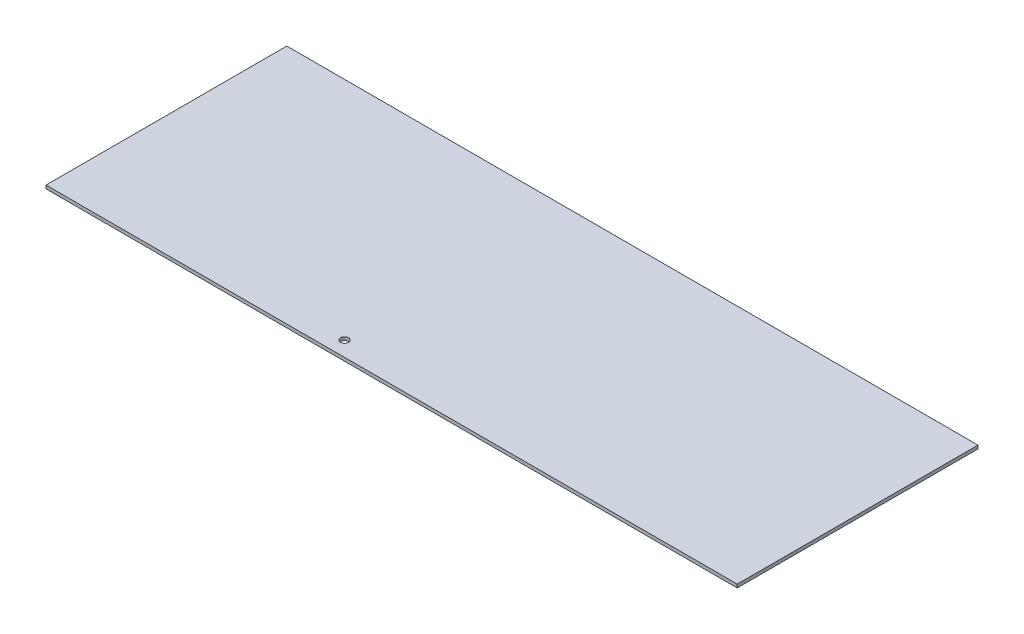
ISO-10303-21;
HEADER;
FILE_DESCRIPTION(('STEP AP214'),'2;1');
FILE_NAME('part.step','',(''),(''),'','','');
FILE_SCHEMA(('AUTOMOTIVE_DESIGN { 1 0 10303 214 1 1 1 1 }'));
ENDSEC;
DATA;
#1=APPLICATION_CONTEXT('core data for automotive mechanical design processes');
#2=APPLICATION_PROTOCOL_DEFINITION('international standard','automotive_design',2000,#1);
#3=PRODUCT_CONTEXT('',#1,'mechanical');
#4=PRODUCT('Part','Part','',(#3));
#5=PRODUCT_RELATED_PRODUCT_CATEGORY('part','',(#4));
#6=PRODUCT_DEFINITION_FORMATION('','',#4);
#7=PRODUCT_DEFINITION_CONTEXT('part definition',#1,'design');
#8=PRODUCT_DEFINITION('design','',#6,#7);
#9=PRODUCT_DEFINITION_SHAPE('','',#8);
#10=(LENGTH_UNIT() NAMED_UNIT(*) SI_UNIT(.MILLI.,.METRE.));
#11=(NAMED_UNIT(*) PLANE_ANGLE_UNIT() SI_UNIT($,.RADIAN.));
#12=(NAMED_UNIT(*) SI_UNIT($,.STERADIAN.) SOLID_ANGLE_UNIT());
#13=UNCERTAINTY_MEASURE_WITH_UNIT(LENGTH_MEASURE(1.E-05),#10,'distance_accuracy_value','');
#14=(GEOMETRIC_REPRESENTATION_CONTEXT(3) GLOBAL_UNCERTAINTY_ASSIGNED_CONTEXT((#13)) GLOBAL_UNIT_ASSIGNED_CONTEXT((#10,
#11,#12)) REPRESENTATION_CONTEXT('',''));
#15=CARTESIAN_POINT('',(0.,0.,0.));
#16=DIRECTION('',(0.,0.,1.));
#17=DIRECTION('',(1.,0.,0.));
#18=AXIS2_PLACEMENT_3D('',#15,#16,#17);
#19=CARTESIAN_POINT('',(0.,1.65,0.));
#20=DIRECTION('',(0.,-1.,0.));
#21=DIRECTION('',(0.,0.,-1.));
#22=AXIS2_PLACEMENT_3D('',#19,#20,#21);
#23=PLANE('',#22);
#24=DIRECTION('',(0.,0.,1.));
#25=VECTOR('',#24,1.);
#26=CARTESIAN_POINT('',(0.,1.65,0.));
#27=LINE('',#26,#25);
#28=CARTESIAN_POINT('',(0.,1.65,-120.));
#29=VERTEX_POINT('',#28);
#30=CARTESIAN_POINT('',(0.,1.65,0.));
#31=VERTEX_POINT('',#30);
#32=EDGE_CURVE('E85',#29,#31,#27,.T.);
#33=ORIENTED_EDGE('',*,*,#32,.T.);
#34=DIRECTION('',(1.,0.,0.));
#35=VECTOR('',#34,1.);
#36=CARTESIAN_POINT('',(0.,1.65,0.));
#37=LINE('',#36,#35);
#38=CARTESIAN_POINT('',(344.4875,1.65,0.));
#39=VERTEX_POINT('',#38);
#40=EDGE_CURVE('E80',#31,#39,#37,.T.);
#41=ORIENTED_EDGE('',*,*,#40,.T.);
#42=DIRECTION('',(0.,0.,-1.));
#43=VECTOR('',#42,1.);
#44=CARTESIAN_POINT('',(344.4875,1.65,0.));
#45=LINE('',#44,#43);
#46=CARTESIAN_POINT('',(344.4875,1.65,-120.));
#47=VERTEX_POINT('',#46);
#48=EDGE_CURVE('E83',#39,#47,#45,.T.);
#49=ORIENTED_EDGE('',*,*,#48,.T.);
#50=DIRECTION('',(-1.,0.,0.));
#51=VECTOR('',#50,1.);
#52=CARTESIAN_POINT('',(0.,1.65,-120.));
#53=LINE('',#52,#51);
#54=EDGE_CURVE('E50',#47,#29,#53,.T.);
#55=ORIENTED_EDGE('',*,*,#54,.T.);
#56=EDGE_LOOP('',(#33,#41,#49,#55));
#57=FACE_BOUND('',#56,.T.);
#58=CARTESIAN_POINT('',(141.2875,1.65,-7.5));
#59=DIRECTION('',(0.,1.,0.));
#60=DIRECTION('',(0.,0.,1.));
#61=AXIS2_PLACEMENT_3D('',#58,#59,#60);
#62=CIRCLE('',#61,2.00000000000002);
#63=CARTESIAN_POINT('',(141.2875,1.65,-5.49999999999998));
#64=VERTEX_POINT('',#63);
#65=EDGE_CURVE('E100',#64,#64,#62,.T.);
#66=ORIENTED_EDGE('',*,*,#65,.F.);
#67=EDGE_LOOP('',(#66));
#68=FACE_BOUND('',#67,.T.);
#69=ADVANCED_FACE('F33',(#57,#68),#23,.F.);
#70=CARTESIAN_POINT('',(0.,0.,0.));
#71=DIRECTION('',(0.,-1.,0.));
#72=DIRECTION('',(0.,0.,-1.));
#73=AXIS2_PLACEMENT_3D('',#70,#71,#72);
#74=PLANE('',#73);
#75=DIRECTION('',(0.,0.,1.));
#76=VECTOR('',#75,1.);
#77=CARTESIAN_POINT('',(0.,0.,0.));
#78=LINE('',#77,#76);
#79=CARTESIAN_POINT('',(0.,0.,-120.));
#80=VERTEX_POINT('',#79);
#81=CARTESIAN_POINT('',(0.,0.,0.));
#82=VERTEX_POINT('',#81);
#83=EDGE_CURVE('E97',#80,#82,#78,.T.);
#84=ORIENTED_EDGE('',*,*,#83,.F.);
#85=DIRECTION('',(-1.,0.,0.));
#86=VECTOR('',#85,1.);
#87=CARTESIAN_POINT('',(0.,0.,-120.));
#88=LINE('',#87,#86);
#89=CARTESIAN_POINT('',(344.4875,0.,-120.));
#90=VERTEX_POINT('',#89);
#91=EDGE_CURVE('E73',#90,#80,#88,.T.);
#92=ORIENTED_EDGE('',*,*,#91,.F.);
#93=DIRECTION('',(0.,0.,-1.));
#94=VECTOR('',#93,1.);
#95=CARTESIAN_POINT('',(344.4875,0.,0.));
#96=LINE('',#95,#94);
#97=CARTESIAN_POINT('',(344.4875,0.,0.));
#98=VERTEX_POINT('',#97);
#99=EDGE_CURVE('E67',#98,#90,#96,.T.);
#100=ORIENTED_EDGE('',*,*,#99,.F.);
#101=DIRECTION('',(1.,0.,0.));
#102=VECTOR('',#101,1.);
#103=CARTESIAN_POINT('',(0.,0.,0.));
#104=LINE('',#103,#102);
#105=EDGE_CURVE('E89',#82,#98,#104,.T.);
#106=ORIENTED_EDGE('',*,*,#105,.F.);
#107=EDGE_LOOP('',(#84,#92,#100,#106));
#108=FACE_BOUND('',#107,.T.);
#109=CARTESIAN_POINT('',(141.2875,0.,-7.5));
#110=DIRECTION('',(0.,1.,0.));
#111=DIRECTION('',(0.,0.,1.));
#112=AXIS2_PLACEMENT_3D('',#109,#110,#111);
#113=CIRCLE('',#112,2.00000000000002);
#114=CARTESIAN_POINT('',(141.2875,0.,-5.49999999999998));
#115=VERTEX_POINT('',#114);
#116=EDGE_CURVE('E112',#115,#115,#113,.T.);
#117=ORIENTED_EDGE('',*,*,#116,.T.);
#118=EDGE_LOOP('',(#117));
#119=FACE_BOUND('',#118,.T.);
#120=ADVANCED_FACE('F108',(#108,#119),#74,.T.);
#121=CARTESIAN_POINT('',(0.,1.65,0.));
#122=DIRECTION('',(1.,0.,0.));
#123=DIRECTION('',(0.,0.,-1.));
#124=AXIS2_PLACEMENT_3D('',#121,#122,#123);
#125=PLANE('',#124);
#126=ORIENTED_EDGE('',*,*,#83,.T.);
#127=DIRECTION('',(0.,-1.,0.));
#128=VECTOR('',#127,1.);
#129=CARTESIAN_POINT('',(0.,1.65,0.));
#130=LINE('',#129,#128);
#131=EDGE_CURVE('E11',#31,#82,#130,.T.);
#132=ORIENTED_EDGE('',*,*,#131,.F.);
#133=ORIENTED_EDGE('',*,*,#32,.F.);
#134=DIRECTION('',(0.,-1.,0.));
#135=VECTOR('',#134,1.);
#136=CARTESIAN_POINT('',(0.,1.65,-120.));
#137=LINE('',#136,#135);
#138=EDGE_CURVE('E93',#29,#80,#137,.T.);
#139=ORIENTED_EDGE('',*,*,#138,.T.);
#140=EDGE_LOOP('',(#126,#132,#133,#139));
#141=FACE_BOUND('',#140,.T.);
#142=ADVANCED_FACE('F35',(#141),#125,.F.);
#143=CARTESIAN_POINT('',(0.,1.65,0.));
#144=DIRECTION('',(0.,0.,-1.));
#145=DIRECTION('',(-1.,0.,0.));
#146=AXIS2_PLACEMENT_3D('',#143,#144,#145);
#147=PLANE('',#146);
#148=ORIENTED_EDGE('',*,*,#105,.T.);
#149=DIRECTION('',(0.,-1.,0.));
#150=VECTOR('',#149,1.);
#151=CARTESIAN_POINT('',(344.4875,1.65,0.));
#152=LINE('',#151,#150);
#153=EDGE_CURVE('E42',#39,#98,#152,.T.);
#154=ORIENTED_EDGE('',*,*,#153,.F.);
#155=ORIENTED_EDGE('',*,*,#40,.F.);
#156=ORIENTED_EDGE('',*,*,#131,.T.);
#157=EDGE_LOOP('',(#148,#154,#155,#156));
#158=FACE_BOUND('',#157,.T.);
#159=ADVANCED_FACE('F88',(#158),#147,.F.);
#160=CARTESIAN_POINT('',(344.4875,1.65,0.));
#161=DIRECTION('',(-1.,0.,0.));
#162=DIRECTION('',(0.,0.,1.));
#163=AXIS2_PLACEMENT_3D('',#160,#161,#162);
#164=PLANE('',#163);
#165=ORIENTED_EDGE('',*,*,#99,.T.);
#166=DIRECTION('',(0.,-1.,0.));
#167=VECTOR('',#166,1.);
#168=CARTESIAN_POINT('',(344.4875,1.65,-120.));
#169=LINE('',#168,#167);
#170=EDGE_CURVE('E90',#47,#90,#169,.T.);
#171=ORIENTED_EDGE('',*,*,#170,.F.);
#172=ORIENTED_EDGE('',*,*,#48,.F.);
#173=ORIENTED_EDGE('',*,*,#153,.T.);
#174=EDGE_LOOP('',(#165,#171,#172,#173));
#175=FACE_BOUND('',#174,.T.);
#176=ADVANCED_FACE('F91',(#175),#164,.F.);
#177=CARTESIAN_POINT('',(0.,1.65,-120.));
#178=DIRECTION('',(0.,0.,1.));
#179=DIRECTION('',(1.,0.,0.));
#180=AXIS2_PLACEMENT_3D('',#177,#178,#179);
#181=PLANE('',#180);
#182=ORIENTED_EDGE('',*,*,#91,.T.);
#183=ORIENTED_EDGE('',*,*,#138,.F.);
#184=ORIENTED_EDGE('',*,*,#54,.F.);
#185=ORIENTED_EDGE('',*,*,#170,.T.);
#186=EDGE_LOOP('',(#182,#183,#184,#185));
#187=FACE_BOUND('',#186,.T.);
#188=ADVANCED_FACE('F105',(#187),#181,.F.);
#189=CARTESIAN_POINT('',(141.2875,1.65,-7.5));
#190=DIRECTION('',(0.,-1.,0.));
#191=DIRECTION('',(0.,0.,-1.));
#192=AXIS2_PLACEMENT_3D('',#189,#190,#191);
#193=CYLINDRICAL_SURFACE('',#192,2.00000000000002);
#194=ORIENTED_EDGE('',*,*,#65,.T.);
#195=EDGE_LOOP('',(#194));
#196=FACE_BOUND('',#195,.T.);
#197=ORIENTED_EDGE('',*,*,#116,.F.);
#198=EDGE_LOOP('',(#197));
#199=FACE_BOUND('',#198,.T.);
#200=ADVANCED_FACE('F118',(#196,#199),#193,.F.);
#201=CLOSED_SHELL('',(#69,#120,#142,#159,#176,#188,#200));
#202=MANIFOLD_SOLID_BREP('B2',#201);
#203=ADVANCED_BREP_SHAPE_REPRESENTATION('',(#18,#202),#14);
#204=SHAPE_DEFINITION_REPRESENTATION(#9,#203);
ENDSEC;
END-ISO-10303-21;
